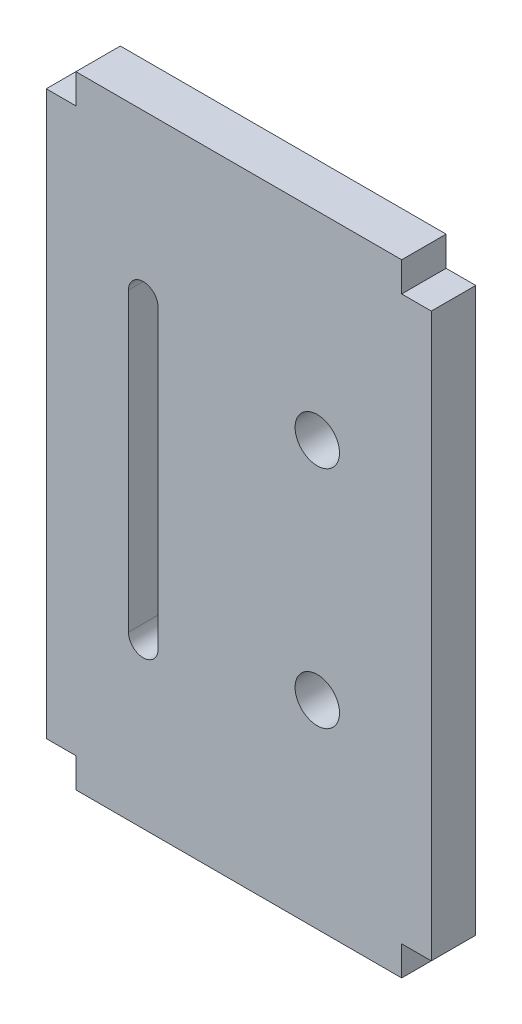
ISO-10303-21;
HEADER;
FILE_DESCRIPTION(('STEP AP214'),'2;1');
FILE_NAME('part.step','',(''),(''),'','','');
FILE_SCHEMA(('AUTOMOTIVE_DESIGN { 1 0 10303 214 1 1 1 1 }'));
ENDSEC;
DATA;
#1=APPLICATION_CONTEXT('core data for automotive mechanical design processes');
#2=APPLICATION_PROTOCOL_DEFINITION('international standard','automotive_design',2000,#1);
#3=PRODUCT_CONTEXT('',#1,'mechanical');
#4=PRODUCT('Part','Part','',(#3));
#5=PRODUCT_RELATED_PRODUCT_CATEGORY('part','',(#4));
#6=PRODUCT_DEFINITION_FORMATION('','',#4);
#7=PRODUCT_DEFINITION_CONTEXT('part definition',#1,'design');
#8=PRODUCT_DEFINITION('design','',#6,#7);
#9=PRODUCT_DEFINITION_SHAPE('','',#8);
#10=(LENGTH_UNIT() NAMED_UNIT(*) SI_UNIT(.MILLI.,.METRE.));
#11=(NAMED_UNIT(*) PLANE_ANGLE_UNIT() SI_UNIT($,.RADIAN.));
#12=(NAMED_UNIT(*) SI_UNIT($,.STERADIAN.) SOLID_ANGLE_UNIT());
#13=UNCERTAINTY_MEASURE_WITH_UNIT(LENGTH_MEASURE(1.E-05),#10,'distance_accuracy_value','');
#14=(GEOMETRIC_REPRESENTATION_CONTEXT(3) GLOBAL_UNCERTAINTY_ASSIGNED_CONTEXT((#13)) GLOBAL_UNIT_ASSIGNED_CONTEXT((#10,
#11,#12)) REPRESENTATION_CONTEXT('',''));
#15=CARTESIAN_POINT('',(0.,0.,0.));
#16=DIRECTION('',(0.,0.,1.));
#17=DIRECTION('',(1.,0.,0.));
#18=AXIS2_PLACEMENT_3D('',#15,#16,#17);
#19=CARTESIAN_POINT('',(-11.,0.,3.));
#20=DIRECTION('',(-1.,0.,0.));
#21=DIRECTION('',(0.,0.,1.));
#22=AXIS2_PLACEMENT_3D('',#19,#20,#21);
#23=PLANE('',#22);
#24=DIRECTION('',(0.,1.,0.));
#25=VECTOR('',#24,1.);
#26=CARTESIAN_POINT('',(-11.,0.,0.));
#27=LINE('',#26,#25);
#28=CARTESIAN_POINT('',(-11.,-21.,0.));
#29=VERTEX_POINT('',#28);
#30=CARTESIAN_POINT('',(-11.,-19.,0.));
#31=VERTEX_POINT('',#30);
#32=EDGE_CURVE('E217',#29,#31,#27,.T.);
#33=ORIENTED_EDGE('',*,*,#32,.F.);
#34=DIRECTION('',(0.,0.,-1.));
#35=VECTOR('',#34,1.);
#36=CARTESIAN_POINT('',(-11.,-21.,3.));
#37=LINE('',#36,#35);
#38=CARTESIAN_POINT('',(-11.,-21.,3.));
#39=VERTEX_POINT('',#38);
#40=EDGE_CURVE('E272',#39,#29,#37,.T.);
#41=ORIENTED_EDGE('',*,*,#40,.F.);
#42=DIRECTION('',(0.,1.,0.));
#43=VECTOR('',#42,1.);
#44=CARTESIAN_POINT('',(-11.,0.,3.));
#45=LINE('',#44,#43);
#46=CARTESIAN_POINT('',(-11.,-19.,3.));
#47=VERTEX_POINT('',#46);
#48=EDGE_CURVE('E187',#39,#47,#45,.T.);
#49=ORIENTED_EDGE('',*,*,#48,.T.);
#50=DIRECTION('',(0.,0.,-1.));
#51=VECTOR('',#50,1.);
#52=CARTESIAN_POINT('',(-11.,-19.,3.));
#53=LINE('',#52,#51);
#54=EDGE_CURVE('E216',#47,#31,#53,.T.);
#55=ORIENTED_EDGE('',*,*,#54,.T.);
#56=EDGE_LOOP('',(#33,#41,#49,#55));
#57=FACE_BOUND('',#56,.T.);
#58=ADVANCED_FACE('F40',(#57),#23,.T.);
#59=CARTESIAN_POINT('',(0.,-21.,3.));
#60=DIRECTION('',(0.,-1.,0.));
#61=DIRECTION('',(1.,0.,0.));
#62=AXIS2_PLACEMENT_3D('',#59,#60,#61);
#63=PLANE('',#62);
#64=DIRECTION('',(-1.,0.,0.));
#65=VECTOR('',#64,1.);
#66=CARTESIAN_POINT('',(0.,-21.,0.));
#67=LINE('',#66,#65);
#68=CARTESIAN_POINT('',(11.,-21.,0.));
#69=VERTEX_POINT('',#68);
#70=EDGE_CURVE('E220',#69,#29,#67,.T.);
#71=ORIENTED_EDGE('',*,*,#70,.F.);
#72=DIRECTION('',(0.,0.,-1.));
#73=VECTOR('',#72,1.);
#74=CARTESIAN_POINT('',(11.,-21.,3.));
#75=LINE('',#74,#73);
#76=CARTESIAN_POINT('',(11.,-21.,3.));
#77=VERTEX_POINT('',#76);
#78=EDGE_CURVE('E270',#77,#69,#75,.T.);
#79=ORIENTED_EDGE('',*,*,#78,.F.);
#80=DIRECTION('',(-1.,0.,0.));
#81=VECTOR('',#80,1.);
#82=CARTESIAN_POINT('',(0.,-21.,3.));
#83=LINE('',#82,#81);
#84=EDGE_CURVE('E191',#77,#39,#83,.T.);
#85=ORIENTED_EDGE('',*,*,#84,.T.);
#86=ORIENTED_EDGE('',*,*,#40,.T.);
#87=EDGE_LOOP('',(#71,#79,#85,#86));
#88=FACE_BOUND('',#87,.T.);
#89=ADVANCED_FACE('F42',(#88),#63,.T.);
#90=CARTESIAN_POINT('',(11.,0.,3.));
#91=DIRECTION('',(-1.,0.,0.));
#92=DIRECTION('',(0.,0.,1.));
#93=AXIS2_PLACEMENT_3D('',#90,#91,#92);
#94=PLANE('',#93);
#95=DIRECTION('',(0.,1.,0.));
#96=VECTOR('',#95,1.);
#97=CARTESIAN_POINT('',(11.,0.,0.));
#98=LINE('',#97,#96);
#99=CARTESIAN_POINT('',(11.,-19.,0.));
#100=VERTEX_POINT('',#99);
#101=EDGE_CURVE('E224',#69,#100,#98,.T.);
#102=ORIENTED_EDGE('',*,*,#101,.T.);
#103=DIRECTION('',(0.,0.,-1.));
#104=VECTOR('',#103,1.);
#105=CARTESIAN_POINT('',(11.,-19.,3.));
#106=LINE('',#105,#104);
#107=CARTESIAN_POINT('',(11.,-19.,3.));
#108=VERTEX_POINT('',#107);
#109=EDGE_CURVE('E267',#108,#100,#106,.T.);
#110=ORIENTED_EDGE('',*,*,#109,.F.);
#111=DIRECTION('',(0.,1.,0.));
#112=VECTOR('',#111,1.);
#113=CARTESIAN_POINT('',(11.,0.,3.));
#114=LINE('',#113,#112);
#115=EDGE_CURVE('E196',#77,#108,#114,.T.);
#116=ORIENTED_EDGE('',*,*,#115,.F.);
#117=ORIENTED_EDGE('',*,*,#78,.T.);
#118=EDGE_LOOP('',(#102,#110,#116,#117));
#119=FACE_BOUND('',#118,.T.);
#120=ADVANCED_FACE('F305',(#119),#94,.F.);
#121=CARTESIAN_POINT('',(0.,-19.,3.));
#122=DIRECTION('',(0.,1.,0.));
#123=DIRECTION('',(0.,0.,1.));
#124=AXIS2_PLACEMENT_3D('',#121,#122,#123);
#125=PLANE('',#124);
#126=DIRECTION('',(1.,0.,0.));
#127=VECTOR('',#126,1.);
#128=CARTESIAN_POINT('',(0.,-19.,0.));
#129=LINE('',#128,#127);
#130=CARTESIAN_POINT('',(13.,-19.,0.));
#131=VERTEX_POINT('',#130);
#132=EDGE_CURVE('E226',#100,#131,#129,.T.);
#133=ORIENTED_EDGE('',*,*,#132,.T.);
#134=DIRECTION('',(0.,0.,-1.));
#135=VECTOR('',#134,1.);
#136=CARTESIAN_POINT('',(13.,-19.,3.));
#137=LINE('',#136,#135);
#138=CARTESIAN_POINT('',(13.,-19.,3.));
#139=VERTEX_POINT('',#138);
#140=EDGE_CURVE('E265',#139,#131,#137,.T.);
#141=ORIENTED_EDGE('',*,*,#140,.F.);
#142=DIRECTION('',(1.,0.,0.));
#143=VECTOR('',#142,1.);
#144=CARTESIAN_POINT('',(0.,-19.,3.));
#145=LINE('',#144,#143);
#146=EDGE_CURVE('E198',#108,#139,#145,.T.);
#147=ORIENTED_EDGE('',*,*,#146,.F.);
#148=ORIENTED_EDGE('',*,*,#109,.T.);
#149=EDGE_LOOP('',(#133,#141,#147,#148));
#150=FACE_BOUND('',#149,.T.);
#151=ADVANCED_FACE('F477',(#150),#125,.F.);
#152=CARTESIAN_POINT('',(13.,0.,3.));
#153=DIRECTION('',(1.,0.,0.));
#154=DIRECTION('',(0.,0.,-1.));
#155=AXIS2_PLACEMENT_3D('',#152,#153,#154);
#156=PLANE('',#155);
#157=DIRECTION('',(0.,-1.,0.));
#158=VECTOR('',#157,1.);
#159=CARTESIAN_POINT('',(13.,0.,0.));
#160=LINE('',#159,#158);
#161=CARTESIAN_POINT('',(13.,19.,0.));
#162=VERTEX_POINT('',#161);
#163=EDGE_CURVE('E230',#162,#131,#160,.T.);
#164=ORIENTED_EDGE('',*,*,#163,.F.);
#165=DIRECTION('',(0.,0.,-1.));
#166=VECTOR('',#165,1.);
#167=CARTESIAN_POINT('',(13.,19.,3.));
#168=LINE('',#167,#166);
#169=CARTESIAN_POINT('',(13.,19.,3.));
#170=VERTEX_POINT('',#169);
#171=EDGE_CURVE('E263',#170,#162,#168,.T.);
#172=ORIENTED_EDGE('',*,*,#171,.F.);
#173=DIRECTION('',(0.,-1.,0.));
#174=VECTOR('',#173,1.);
#175=CARTESIAN_POINT('',(13.,0.,3.));
#176=LINE('',#175,#174);
#177=EDGE_CURVE('E201',#170,#139,#176,.T.);
#178=ORIENTED_EDGE('',*,*,#177,.T.);
#179=ORIENTED_EDGE('',*,*,#140,.T.);
#180=EDGE_LOOP('',(#164,#172,#178,#179));
#181=FACE_BOUND('',#180,.T.);
#182=ADVANCED_FACE('F468',(#181),#156,.T.);
#183=CARTESIAN_POINT('',(0.,19.,3.));
#184=DIRECTION('',(0.,1.,0.));
#185=DIRECTION('',(0.,0.,1.));
#186=AXIS2_PLACEMENT_3D('',#183,#184,#185);
#187=PLANE('',#186);
#188=DIRECTION('',(1.,0.,0.));
#189=VECTOR('',#188,1.);
#190=CARTESIAN_POINT('',(0.,19.,0.));
#191=LINE('',#190,#189);
#192=CARTESIAN_POINT('',(11.,19.,0.));
#193=VERTEX_POINT('',#192);
#194=EDGE_CURVE('E233',#193,#162,#191,.T.);
#195=ORIENTED_EDGE('',*,*,#194,.F.);
#196=DIRECTION('',(0.,0.,-1.));
#197=VECTOR('',#196,1.);
#198=CARTESIAN_POINT('',(11.,19.,3.));
#199=LINE('',#198,#197);
#200=CARTESIAN_POINT('',(11.,19.,3.));
#201=VERTEX_POINT('',#200);
#202=EDGE_CURVE('E261',#201,#193,#199,.T.);
#203=ORIENTED_EDGE('',*,*,#202,.F.);
#204=DIRECTION('',(1.,0.,0.));
#205=VECTOR('',#204,1.);
#206=CARTESIAN_POINT('',(0.,19.,3.));
#207=LINE('',#206,#205);
#208=EDGE_CURVE('E204',#201,#170,#207,.T.);
#209=ORIENTED_EDGE('',*,*,#208,.T.);
#210=ORIENTED_EDGE('',*,*,#171,.T.);
#211=EDGE_LOOP('',(#195,#203,#209,#210));
#212=FACE_BOUND('',#211,.T.);
#213=ADVANCED_FACE('F430',(#212),#187,.T.);
#214=CARTESIAN_POINT('',(11.,21.,0.));
#215=VERTEX_POINT('',#214);
#216=EDGE_CURVE('E227',#193,#215,#98,.T.);
#217=ORIENTED_EDGE('',*,*,#216,.T.);
#218=DIRECTION('',(0.,0.,-1.));
#219=VECTOR('',#218,1.);
#220=CARTESIAN_POINT('',(11.,21.,3.));
#221=LINE('',#220,#219);
#222=CARTESIAN_POINT('',(11.,21.,3.));
#223=VERTEX_POINT('',#222);
#224=EDGE_CURVE('E258',#223,#215,#221,.T.);
#225=ORIENTED_EDGE('',*,*,#224,.F.);
#226=EDGE_CURVE('E199',#201,#223,#114,.T.);
#227=ORIENTED_EDGE('',*,*,#226,.F.);
#228=ORIENTED_EDGE('',*,*,#202,.T.);
#229=EDGE_LOOP('',(#217,#225,#227,#228));
#230=FACE_BOUND('',#229,.T.);
#231=ADVANCED_FACE('F320',(#230),#94,.F.);
#232=CARTESIAN_POINT('',(0.,21.,3.));
#233=DIRECTION('',(0.,-1.,0.));
#234=DIRECTION('',(0.,0.,-1.));
#235=AXIS2_PLACEMENT_3D('',#232,#233,#234);
#236=PLANE('',#235);
#237=DIRECTION('',(-1.,0.,0.));
#238=VECTOR('',#237,1.);
#239=CARTESIAN_POINT('',(0.,21.,0.));
#240=LINE('',#239,#238);
#241=CARTESIAN_POINT('',(-11.,21.,0.));
#242=VERTEX_POINT('',#241);
#243=EDGE_CURVE('E236',#215,#242,#240,.T.);
#244=ORIENTED_EDGE('',*,*,#243,.T.);
#245=DIRECTION('',(0.,0.,-1.));
#246=VECTOR('',#245,1.);
#247=CARTESIAN_POINT('',(-11.,21.,3.));
#248=LINE('',#247,#246);
#249=CARTESIAN_POINT('',(-11.,21.,3.));
#250=VERTEX_POINT('',#249);
#251=EDGE_CURVE('E255',#250,#242,#248,.T.);
#252=ORIENTED_EDGE('',*,*,#251,.F.);
#253=DIRECTION('',(-1.,0.,0.));
#254=VECTOR('',#253,1.);
#255=CARTESIAN_POINT('',(0.,21.,3.));
#256=LINE('',#255,#254);
#257=EDGE_CURVE('E207',#223,#250,#256,.T.);
#258=ORIENTED_EDGE('',*,*,#257,.F.);
#259=ORIENTED_EDGE('',*,*,#224,.T.);
#260=EDGE_LOOP('',(#244,#252,#258,#259));
#261=FACE_BOUND('',#260,.T.);
#262=ADVANCED_FACE('F312',(#261),#236,.F.);
#263=CARTESIAN_POINT('',(-11.,19.,0.));
#264=VERTEX_POINT('',#263);
#265=EDGE_CURVE('E221',#264,#242,#27,.T.);
#266=ORIENTED_EDGE('',*,*,#265,.F.);
#267=DIRECTION('',(0.,0.,-1.));
#268=VECTOR('',#267,1.);
#269=CARTESIAN_POINT('',(-11.,19.,3.));
#270=LINE('',#269,#268);
#271=CARTESIAN_POINT('',(-11.,19.,3.));
#272=VERTEX_POINT('',#271);
#273=EDGE_CURVE('E253',#272,#264,#270,.T.);
#274=ORIENTED_EDGE('',*,*,#273,.F.);
#275=EDGE_CURVE('E193',#272,#250,#45,.T.);
#276=ORIENTED_EDGE('',*,*,#275,.T.);
#277=ORIENTED_EDGE('',*,*,#251,.T.);
#278=EDGE_LOOP('',(#266,#274,#276,#277));
#279=FACE_BOUND('',#278,.T.);
#280=ADVANCED_FACE('F301',(#279),#23,.T.);
#281=CARTESIAN_POINT('',(0.,19.,3.));
#282=DIRECTION('',(0.,-1.,0.));
#283=DIRECTION('',(0.,0.,-1.));
#284=AXIS2_PLACEMENT_3D('',#281,#282,#283);
#285=PLANE('',#284);
#286=DIRECTION('',(-1.,0.,0.));
#287=VECTOR('',#286,1.);
#288=CARTESIAN_POINT('',(0.,19.,0.));
#289=LINE('',#288,#287);
#290=CARTESIAN_POINT('',(-13.,19.,0.));
#291=VERTEX_POINT('',#290);
#292=EDGE_CURVE('E239',#264,#291,#289,.T.);
#293=ORIENTED_EDGE('',*,*,#292,.T.);
#294=DIRECTION('',(0.,0.,-1.));
#295=VECTOR('',#294,1.);
#296=CARTESIAN_POINT('',(-13.,19.,3.));
#297=LINE('',#296,#295);
#298=CARTESIAN_POINT('',(-13.,19.,3.));
#299=VERTEX_POINT('',#298);
#300=EDGE_CURVE('E250',#299,#291,#297,.T.);
#301=ORIENTED_EDGE('',*,*,#300,.F.);
#302=DIRECTION('',(-1.,0.,0.));
#303=VECTOR('',#302,1.);
#304=CARTESIAN_POINT('',(0.,19.,3.));
#305=LINE('',#304,#303);
#306=EDGE_CURVE('E209',#272,#299,#305,.T.);
#307=ORIENTED_EDGE('',*,*,#306,.F.);
#308=ORIENTED_EDGE('',*,*,#273,.T.);
#309=EDGE_LOOP('',(#293,#301,#307,#308));
#310=FACE_BOUND('',#309,.T.);
#311=ADVANCED_FACE('F311',(#310),#285,.F.);
#312=CARTESIAN_POINT('',(-13.,0.,3.));
#313=DIRECTION('',(1.,0.,0.));
#314=DIRECTION('',(0.,0.,-1.));
#315=AXIS2_PLACEMENT_3D('',#312,#313,#314);
#316=PLANE('',#315);
#317=DIRECTION('',(0.,-1.,0.));
#318=VECTOR('',#317,1.);
#319=CARTESIAN_POINT('',(-13.,0.,0.));
#320=LINE('',#319,#318);
#321=CARTESIAN_POINT('',(-13.,-19.,0.));
#322=VERTEX_POINT('',#321);
#323=EDGE_CURVE('E241',#291,#322,#320,.T.);
#324=ORIENTED_EDGE('',*,*,#323,.T.);
#325=DIRECTION('',(0.,0.,-1.));
#326=VECTOR('',#325,1.);
#327=CARTESIAN_POINT('',(-13.,-19.,3.));
#328=LINE('',#327,#326);
#329=CARTESIAN_POINT('',(-13.,-19.,3.));
#330=VERTEX_POINT('',#329);
#331=EDGE_CURVE('E248',#330,#322,#328,.T.);
#332=ORIENTED_EDGE('',*,*,#331,.F.);
#333=DIRECTION('',(0.,-1.,0.));
#334=VECTOR('',#333,1.);
#335=CARTESIAN_POINT('',(-13.,0.,3.));
#336=LINE('',#335,#334);
#337=EDGE_CURVE('E211',#299,#330,#336,.T.);
#338=ORIENTED_EDGE('',*,*,#337,.F.);
#339=ORIENTED_EDGE('',*,*,#300,.T.);
#340=EDGE_LOOP('',(#324,#332,#338,#339));
#341=FACE_BOUND('',#340,.T.);
#342=ADVANCED_FACE('F318',(#341),#316,.F.);
#343=CARTESIAN_POINT('',(0.,-19.,3.));
#344=DIRECTION('',(0.,-1.,0.));
#345=DIRECTION('',(0.,0.,-1.));
#346=AXIS2_PLACEMENT_3D('',#343,#344,#345);
#347=PLANE('',#346);
#348=DIRECTION('',(-1.,0.,0.));
#349=VECTOR('',#348,1.);
#350=CARTESIAN_POINT('',(0.,-19.,0.));
#351=LINE('',#350,#349);
#352=EDGE_CURVE('E192',#31,#322,#351,.T.);
#353=ORIENTED_EDGE('',*,*,#352,.F.);
#354=ORIENTED_EDGE('',*,*,#54,.F.);
#355=DIRECTION('',(-1.,0.,0.));
#356=VECTOR('',#355,1.);
#357=CARTESIAN_POINT('',(0.,-19.,3.));
#358=LINE('',#357,#356);
#359=EDGE_CURVE('E213',#47,#330,#358,.T.);
#360=ORIENTED_EDGE('',*,*,#359,.T.);
#361=ORIENTED_EDGE('',*,*,#331,.T.);
#362=EDGE_LOOP('',(#353,#354,#360,#361));
#363=FACE_BOUND('',#362,.T.);
#364=ADVANCED_FACE('F375',(#363),#347,.T.);
#365=CARTESIAN_POINT('',(0.,0.,3.));
#366=DIRECTION('',(0.,0.,1.));
#367=DIRECTION('',(1.,0.,0.));
#368=AXIS2_PLACEMENT_3D('',#365,#366,#367);
#369=PLANE('',#368);
#370=CARTESIAN_POINT('',(5.3,7.60000000000001,3.));
#371=DIRECTION('',(0.,0.,1.));
#372=DIRECTION('',(1.,0.,0.));
#373=AXIS2_PLACEMENT_3D('',#370,#371,#372);
#374=CIRCLE('',#373,1.5);
#375=CARTESIAN_POINT('',(6.8,7.60000000000001,3.));
#376=VERTEX_POINT('',#375);
#377=EDGE_CURVE('E180',#376,#376,#374,.T.);
#378=ORIENTED_EDGE('',*,*,#377,.F.);
#379=EDGE_LOOP('',(#378));
#380=FACE_BOUND('',#379,.T.);
#381=CARTESIAN_POINT('',(-6.45,-10.,3.));
#382=DIRECTION('',(0.,0.,1.));
#383=DIRECTION('',(1.,0.,0.));
#384=AXIS2_PLACEMENT_3D('',#381,#382,#383);
#385=CIRCLE('',#384,1.);
#386=CARTESIAN_POINT('',(-7.45,-10.,3.));
#387=VERTEX_POINT('',#386);
#388=CARTESIAN_POINT('',(-5.45,-10.,3.));
#389=VERTEX_POINT('',#388);
#390=EDGE_CURVE('E56',#387,#389,#385,.T.);
#391=ORIENTED_EDGE('',*,*,#390,.F.);
#392=DIRECTION('',(0.,-1.,0.));
#393=VECTOR('',#392,1.);
#394=CARTESIAN_POINT('',(-7.45,-10.,3.));
#395=LINE('',#394,#393);
#396=CARTESIAN_POINT('',(-7.45,10.,3.));
#397=VERTEX_POINT('',#396);
#398=EDGE_CURVE('E173',#397,#387,#395,.T.);
#399=ORIENTED_EDGE('',*,*,#398,.F.);
#400=CARTESIAN_POINT('',(-6.45,10.,3.));
#401=DIRECTION('',(0.,0.,1.));
#402=DIRECTION('',(1.,0.,0.));
#403=AXIS2_PLACEMENT_3D('',#400,#401,#402);
#404=CIRCLE('',#403,1.);
#405=CARTESIAN_POINT('',(-5.45,10.,3.));
#406=VERTEX_POINT('',#405);
#407=EDGE_CURVE('E157',#406,#397,#404,.T.);
#408=ORIENTED_EDGE('',*,*,#407,.F.);
#409=DIRECTION('',(0.,1.,0.));
#410=VECTOR('',#409,1.);
#411=CARTESIAN_POINT('',(-5.45,-10.,3.));
#412=LINE('',#411,#410);
#413=EDGE_CURVE('E166',#389,#406,#412,.T.);
#414=ORIENTED_EDGE('',*,*,#413,.F.);
#415=EDGE_LOOP('',(#391,#399,#408,#414));
#416=FACE_BOUND('',#415,.T.);
#417=CARTESIAN_POINT('',(5.3,-7.59999999999999,3.));
#418=DIRECTION('',(0.,0.,1.));
#419=DIRECTION('',(1.,0.,0.));
#420=AXIS2_PLACEMENT_3D('',#417,#418,#419);
#421=CIRCLE('',#420,1.5);
#422=CARTESIAN_POINT('',(6.8,-7.59999999999999,3.));
#423=VERTEX_POINT('',#422);
#424=EDGE_CURVE('E183',#423,#423,#421,.T.);
#425=ORIENTED_EDGE('',*,*,#424,.F.);
#426=EDGE_LOOP('',(#425));
#427=FACE_BOUND('',#426,.T.);
#428=ORIENTED_EDGE('',*,*,#48,.F.);
#429=ORIENTED_EDGE('',*,*,#84,.F.);
#430=ORIENTED_EDGE('',*,*,#115,.T.);
#431=ORIENTED_EDGE('',*,*,#146,.T.);
#432=ORIENTED_EDGE('',*,*,#177,.F.);
#433=ORIENTED_EDGE('',*,*,#208,.F.);
#434=ORIENTED_EDGE('',*,*,#226,.T.);
#435=ORIENTED_EDGE('',*,*,#257,.T.);
#436=ORIENTED_EDGE('',*,*,#275,.F.);
#437=ORIENTED_EDGE('',*,*,#306,.T.);
#438=ORIENTED_EDGE('',*,*,#337,.T.);
#439=ORIENTED_EDGE('',*,*,#359,.F.);
#440=EDGE_LOOP('',(#428,#429,#430,#431,#432,#433,#434,#435,#436,#437,#438,#439));
#441=FACE_BOUND('',#440,.T.);
#442=ADVANCED_FACE('F170',(#380,#416,#427,#441),#369,.T.);
#443=CARTESIAN_POINT('',(0.,0.,0.));
#444=DIRECTION('',(0.,0.,1.));
#445=DIRECTION('',(1.,0.,0.));
#446=AXIS2_PLACEMENT_3D('',#443,#444,#445);
#447=PLANE('',#446);
#448=CARTESIAN_POINT('',(5.3,7.60000000000001,0.));
#449=DIRECTION('',(0.,0.,1.));
#450=DIRECTION('',(1.,0.,0.));
#451=AXIS2_PLACEMENT_3D('',#448,#449,#450);
#452=CIRCLE('',#451,1.5);
#453=CARTESIAN_POINT('',(6.8,7.60000000000001,0.));
#454=VERTEX_POINT('',#453);
#455=EDGE_CURVE('E44',#454,#454,#452,.T.);
#456=ORIENTED_EDGE('',*,*,#455,.T.);
#457=EDGE_LOOP('',(#456));
#458=FACE_BOUND('',#457,.T.);
#459=DIRECTION('',(0.,-1.,0.));
#460=VECTOR('',#459,1.);
#461=CARTESIAN_POINT('',(-7.45,0.,0.));
#462=LINE('',#461,#460);
#463=CARTESIAN_POINT('',(-7.45,10.,0.));
#464=VERTEX_POINT('',#463);
#465=CARTESIAN_POINT('',(-7.45,-10.,0.));
#466=VERTEX_POINT('',#465);
#467=EDGE_CURVE('E49',#464,#466,#462,.T.);
#468=ORIENTED_EDGE('',*,*,#467,.T.);
#469=CARTESIAN_POINT('',(-6.45,-10.,0.));
#470=DIRECTION('',(0.,0.,1.));
#471=DIRECTION('',(1.,0.,0.));
#472=AXIS2_PLACEMENT_3D('',#469,#470,#471);
#473=CIRCLE('',#472,1.);
#474=CARTESIAN_POINT('',(-5.45,-10.,0.));
#475=VERTEX_POINT('',#474);
#476=EDGE_CURVE('E11',#466,#475,#473,.T.);
#477=ORIENTED_EDGE('',*,*,#476,.T.);
#478=DIRECTION('',(0.,1.,0.));
#479=VECTOR('',#478,1.);
#480=CARTESIAN_POINT('',(-5.45,0.,0.));
#481=LINE('',#480,#479);
#482=CARTESIAN_POINT('',(-5.45,10.,0.));
#483=VERTEX_POINT('',#482);
#484=EDGE_CURVE('E274',#475,#483,#481,.T.);
#485=ORIENTED_EDGE('',*,*,#484,.T.);
#486=CARTESIAN_POINT('',(-6.45,10.,0.));
#487=DIRECTION('',(0.,0.,1.));
#488=DIRECTION('',(1.,0.,0.));
#489=AXIS2_PLACEMENT_3D('',#486,#487,#488);
#490=CIRCLE('',#489,1.);
#491=EDGE_CURVE('E160',#483,#464,#490,.T.);
#492=ORIENTED_EDGE('',*,*,#491,.T.);
#493=EDGE_LOOP('',(#468,#477,#485,#492));
#494=FACE_BOUND('',#493,.T.);
#495=CARTESIAN_POINT('',(5.3,-7.59999999999999,0.));
#496=DIRECTION('',(0.,0.,1.));
#497=DIRECTION('',(1.,0.,0.));
#498=AXIS2_PLACEMENT_3D('',#495,#496,#497);
#499=CIRCLE('',#498,1.5);
#500=CARTESIAN_POINT('',(6.8,-7.59999999999999,0.));
#501=VERTEX_POINT('',#500);
#502=EDGE_CURVE('E186',#501,#501,#499,.T.);
#503=ORIENTED_EDGE('',*,*,#502,.T.);
#504=EDGE_LOOP('',(#503));
#505=FACE_BOUND('',#504,.T.);
#506=ORIENTED_EDGE('',*,*,#32,.T.);
#507=ORIENTED_EDGE('',*,*,#352,.T.);
#508=ORIENTED_EDGE('',*,*,#323,.F.);
#509=ORIENTED_EDGE('',*,*,#292,.F.);
#510=ORIENTED_EDGE('',*,*,#265,.T.);
#511=ORIENTED_EDGE('',*,*,#243,.F.);
#512=ORIENTED_EDGE('',*,*,#216,.F.);
#513=ORIENTED_EDGE('',*,*,#194,.T.);
#514=ORIENTED_EDGE('',*,*,#163,.T.);
#515=ORIENTED_EDGE('',*,*,#132,.F.);
#516=ORIENTED_EDGE('',*,*,#101,.F.);
#517=ORIENTED_EDGE('',*,*,#70,.T.);
#518=EDGE_LOOP('',(#506,#507,#508,#509,#510,#511,#512,#513,#514,#515,#516,#517));
#519=FACE_BOUND('',#518,.T.);
#520=ADVANCED_FACE('F281',(#458,#494,#505,#519),#447,.F.);
#521=CARTESIAN_POINT('',(5.3,-7.59999999999999,-7.));
#522=DIRECTION('',(0.,0.,1.));
#523=DIRECTION('',(1.,0.,0.));
#524=AXIS2_PLACEMENT_3D('',#521,#522,#523);
#525=CYLINDRICAL_SURFACE('',#524,1.5);
#526=ORIENTED_EDGE('',*,*,#424,.T.);
#527=EDGE_LOOP('',(#526));
#528=FACE_BOUND('',#527,.T.);
#529=ORIENTED_EDGE('',*,*,#502,.F.);
#530=EDGE_LOOP('',(#529));
#531=FACE_BOUND('',#530,.T.);
#532=ADVANCED_FACE('F288',(#528,#531),#525,.F.);
#533=CARTESIAN_POINT('',(-6.45,-10.,-7.));
#534=DIRECTION('',(0.,0.,1.));
#535=DIRECTION('',(1.,0.,0.));
#536=AXIS2_PLACEMENT_3D('',#533,#534,#535);
#537=CYLINDRICAL_SURFACE('',#536,1.);
#538=DIRECTION('',(0.,0.,1.));
#539=VECTOR('',#538,1.);
#540=CARTESIAN_POINT('',(-7.45,-10.,-7.));
#541=LINE('',#540,#539);
#542=EDGE_CURVE('E178',#466,#387,#541,.T.);
#543=ORIENTED_EDGE('',*,*,#542,.T.);
#544=ORIENTED_EDGE('',*,*,#390,.T.);
#545=DIRECTION('',(0.,0.,1.));
#546=VECTOR('',#545,1.);
#547=CARTESIAN_POINT('',(-5.45,-10.,-7.));
#548=LINE('',#547,#546);
#549=EDGE_CURVE('E163',#475,#389,#548,.T.);
#550=ORIENTED_EDGE('',*,*,#549,.F.);
#551=ORIENTED_EDGE('',*,*,#476,.F.);
#552=EDGE_LOOP('',(#543,#544,#550,#551));
#553=FACE_BOUND('',#552,.T.);
#554=ADVANCED_FACE('F286',(#553),#537,.F.);
#555=CARTESIAN_POINT('',(-7.45,-10.,-7.));
#556=DIRECTION('',(-1.,0.,0.));
#557=DIRECTION('',(0.,-1.,0.));
#558=AXIS2_PLACEMENT_3D('',#555,#556,#557);
#559=PLANE('',#558);
#560=DIRECTION('',(0.,0.,1.));
#561=VECTOR('',#560,1.);
#562=CARTESIAN_POINT('',(-7.45,10.,-7.));
#563=LINE('',#562,#561);
#564=EDGE_CURVE('E162',#464,#397,#563,.T.);
#565=ORIENTED_EDGE('',*,*,#564,.T.);
#566=ORIENTED_EDGE('',*,*,#398,.T.);
#567=ORIENTED_EDGE('',*,*,#542,.F.);
#568=ORIENTED_EDGE('',*,*,#467,.F.);
#569=EDGE_LOOP('',(#565,#566,#567,#568));
#570=FACE_BOUND('',#569,.T.);
#571=ADVANCED_FACE('F285',(#570),#559,.F.);
#572=CARTESIAN_POINT('',(-6.45,10.,-7.));
#573=DIRECTION('',(0.,0.,1.));
#574=DIRECTION('',(1.,0.,0.));
#575=AXIS2_PLACEMENT_3D('',#572,#573,#574);
#576=CYLINDRICAL_SURFACE('',#575,1.);
#577=DIRECTION('',(0.,0.,1.));
#578=VECTOR('',#577,1.);
#579=CARTESIAN_POINT('',(-5.45,10.,-7.));
#580=LINE('',#579,#578);
#581=EDGE_CURVE('E64',#483,#406,#580,.T.);
#582=ORIENTED_EDGE('',*,*,#581,.T.);
#583=ORIENTED_EDGE('',*,*,#407,.T.);
#584=ORIENTED_EDGE('',*,*,#564,.F.);
#585=ORIENTED_EDGE('',*,*,#491,.F.);
#586=EDGE_LOOP('',(#582,#583,#584,#585));
#587=FACE_BOUND('',#586,.T.);
#588=ADVANCED_FACE('F154',(#587),#576,.F.);
#589=CARTESIAN_POINT('',(-5.45,-10.,-7.));
#590=DIRECTION('',(1.,0.,0.));
#591=DIRECTION('',(0.,0.,-1.));
#592=AXIS2_PLACEMENT_3D('',#589,#590,#591);
#593=PLANE('',#592);
#594=ORIENTED_EDGE('',*,*,#549,.T.);
#595=ORIENTED_EDGE('',*,*,#413,.T.);
#596=ORIENTED_EDGE('',*,*,#581,.F.);
#597=ORIENTED_EDGE('',*,*,#484,.F.);
#598=EDGE_LOOP('',(#594,#595,#596,#597));
#599=FACE_BOUND('',#598,.T.);
#600=ADVANCED_FACE('F167',(#599),#593,.F.);
#601=CARTESIAN_POINT('',(5.3,7.60000000000001,-7.));
#602=DIRECTION('',(0.,0.,1.));
#603=DIRECTION('',(1.,0.,0.));
#604=AXIS2_PLACEMENT_3D('',#601,#602,#603);
#605=CYLINDRICAL_SURFACE('',#604,1.5);
#606=ORIENTED_EDGE('',*,*,#377,.T.);
#607=EDGE_LOOP('',(#606));
#608=FACE_BOUND('',#607,.T.);
#609=ORIENTED_EDGE('',*,*,#455,.F.);
#610=EDGE_LOOP('',(#609));
#611=FACE_BOUND('',#610,.T.);
#612=ADVANCED_FACE('F350',(#608,#611),#605,.F.);
#613=CLOSED_SHELL('',(#58,#89,#120,#151,#182,#213,#231,#262,#280,#311,#342,#364,#442,#520,#532,
#554,#571,#588,#600,#612));
#614=MANIFOLD_SOLID_BREP('B2',#613);
#615=ADVANCED_BREP_SHAPE_REPRESENTATION('',(#18,#614),#14);
#616=SHAPE_DEFINITION_REPRESENTATION(#9,#615);
ENDSEC;
END-ISO-10303-21;
